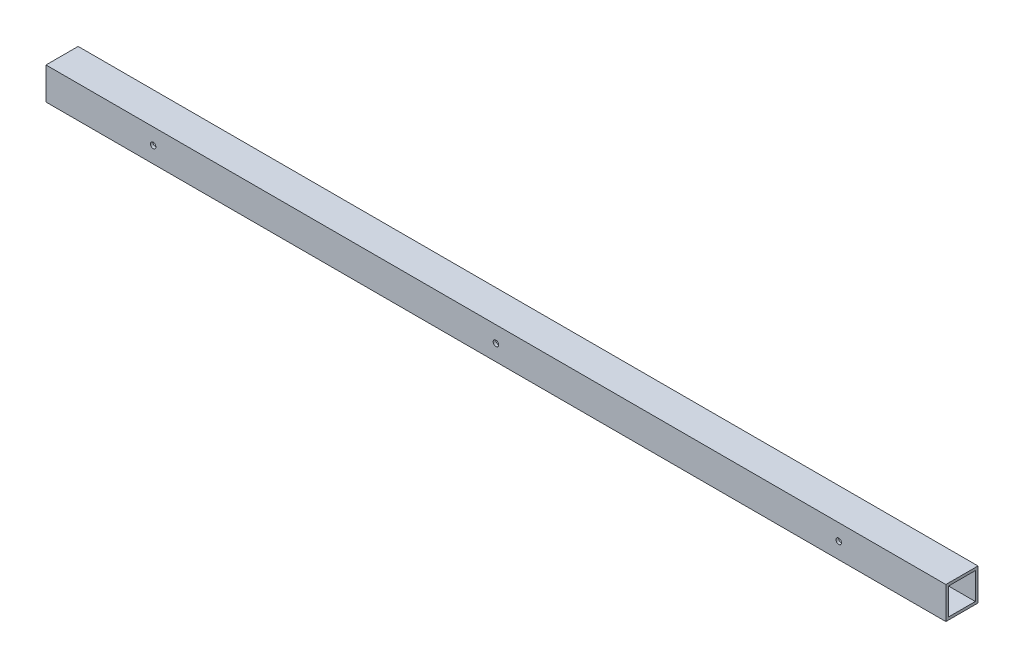
ISO-10303-21;
HEADER;
FILE_DESCRIPTION(('STEP AP214'),'2;1');
FILE_NAME('part.step','',(''),(''),'','','');
FILE_SCHEMA(('AUTOMOTIVE_DESIGN { 1 0 10303 214 1 1 1 1 }'));
ENDSEC;
DATA;
#1=APPLICATION_CONTEXT('core data for automotive mechanical design processes');
#2=APPLICATION_PROTOCOL_DEFINITION('international standard','automotive_design',2000,#1);
#3=PRODUCT_CONTEXT('',#1,'mechanical');
#4=PRODUCT('Part','Part','',(#3));
#5=PRODUCT_RELATED_PRODUCT_CATEGORY('part','',(#4));
#6=PRODUCT_DEFINITION_FORMATION('','',#4);
#7=PRODUCT_DEFINITION_CONTEXT('part definition',#1,'design');
#8=PRODUCT_DEFINITION('design','',#6,#7);
#9=PRODUCT_DEFINITION_SHAPE('','',#8);
#10=(LENGTH_UNIT() NAMED_UNIT(*) SI_UNIT(.MILLI.,.METRE.));
#11=(NAMED_UNIT(*) PLANE_ANGLE_UNIT() SI_UNIT($,.RADIAN.));
#12=(NAMED_UNIT(*) SI_UNIT($,.STERADIAN.) SOLID_ANGLE_UNIT());
#13=UNCERTAINTY_MEASURE_WITH_UNIT(LENGTH_MEASURE(1.E-05),#10,'distance_accuracy_value','');
#14=(GEOMETRIC_REPRESENTATION_CONTEXT(3) GLOBAL_UNCERTAINTY_ASSIGNED_CONTEXT((#13)) GLOBAL_UNIT_ASSIGNED_CONTEXT((#10,
#11,#12)) REPRESENTATION_CONTEXT('',''));
#15=CARTESIAN_POINT('',(0.,0.,0.));
#16=DIRECTION('',(0.,0.,1.));
#17=DIRECTION('',(1.,0.,0.));
#18=AXIS2_PLACEMENT_3D('',#15,#16,#17);
#19=CARTESIAN_POINT('',(0.,0.,22.86));
#20=DIRECTION('',(0.,0.,-1.));
#21=DIRECTION('',(-1.,0.,0.));
#22=AXIS2_PLACEMENT_3D('',#19,#20,#21);
#23=CYLINDRICAL_SURFACE('',#22,3.302);
#24=CARTESIAN_POINT('',(0.,0.,19.05));
#25=DIRECTION('',(0.,0.,-1.));
#26=DIRECTION('',(-1.,0.,0.));
#27=AXIS2_PLACEMENT_3D('',#24,#25,#26);
#28=CIRCLE('',#27,3.302);
#29=CARTESIAN_POINT('',(-3.302,0.,19.05));
#30=VERTEX_POINT('',#29);
#31=EDGE_CURVE('E120',#30,#30,#28,.T.);
#32=ORIENTED_EDGE('',*,*,#31,.F.);
#33=EDGE_LOOP('',(#32));
#34=FACE_BOUND('',#33,.T.);
#35=CARTESIAN_POINT('',(0.,0.,15.875));
#36=DIRECTION('',(0.,0.,-1.));
#37=DIRECTION('',(-1.,0.,0.));
#38=AXIS2_PLACEMENT_3D('',#35,#36,#37);
#39=CIRCLE('',#38,3.302);
#40=CARTESIAN_POINT('',(-3.302,0.,15.875));
#41=VERTEX_POINT('',#40);
#42=EDGE_CURVE('E91',#41,#41,#39,.F.);
#43=ORIENTED_EDGE('',*,*,#42,.F.);
#44=EDGE_LOOP('',(#43));
#45=FACE_BOUND('',#44,.T.);
#46=ADVANCED_FACE('F17',(#34,#45),#23,.F.);
#47=CARTESIAN_POINT('',(406.4,0.,22.86));
#48=DIRECTION('',(0.,0.,-1.));
#49=DIRECTION('',(-1.,0.,0.));
#50=AXIS2_PLACEMENT_3D('',#47,#48,#49);
#51=CYLINDRICAL_SURFACE('',#50,3.302);
#52=CARTESIAN_POINT('',(406.4,0.,15.875));
#53=DIRECTION('',(0.,0.,-1.));
#54=DIRECTION('',(-1.,0.,0.));
#55=AXIS2_PLACEMENT_3D('',#52,#53,#54);
#56=CIRCLE('',#55,3.302);
#57=CARTESIAN_POINT('',(403.098,0.,15.875));
#58=VERTEX_POINT('',#57);
#59=EDGE_CURVE('E147',#58,#58,#56,.F.);
#60=ORIENTED_EDGE('',*,*,#59,.F.);
#61=EDGE_LOOP('',(#60));
#62=FACE_BOUND('',#61,.T.);
#63=CARTESIAN_POINT('',(406.4,0.,19.05));
#64=DIRECTION('',(0.,0.,-1.));
#65=DIRECTION('',(-1.,0.,0.));
#66=AXIS2_PLACEMENT_3D('',#63,#64,#65);
#67=CIRCLE('',#66,3.302);
#68=CARTESIAN_POINT('',(403.098,0.,19.05));
#69=VERTEX_POINT('',#68);
#70=EDGE_CURVE('E140',#69,#69,#67,.T.);
#71=ORIENTED_EDGE('',*,*,#70,.F.);
#72=EDGE_LOOP('',(#71));
#73=FACE_BOUND('',#72,.T.);
#74=ADVANCED_FACE('F329',(#62,#73),#51,.F.);
#75=CARTESIAN_POINT('',(-406.4,0.,22.86));
#76=DIRECTION('',(0.,0.,-1.));
#77=DIRECTION('',(-1.,0.,0.));
#78=AXIS2_PLACEMENT_3D('',#75,#76,#77);
#79=CYLINDRICAL_SURFACE('',#78,3.302);
#80=CARTESIAN_POINT('',(-406.4,0.,15.875));
#81=DIRECTION('',(0.,0.,-1.));
#82=DIRECTION('',(-1.,0.,0.));
#83=AXIS2_PLACEMENT_3D('',#80,#81,#82);
#84=CIRCLE('',#83,3.302);
#85=CARTESIAN_POINT('',(-409.702,0.,15.875));
#86=VERTEX_POINT('',#85);
#87=EDGE_CURVE('E123',#86,#86,#84,.F.);
#88=ORIENTED_EDGE('',*,*,#87,.F.);
#89=EDGE_LOOP('',(#88));
#90=FACE_BOUND('',#89,.T.);
#91=CARTESIAN_POINT('',(-406.4,0.,19.05));
#92=DIRECTION('',(0.,0.,-1.));
#93=DIRECTION('',(-1.,0.,0.));
#94=AXIS2_PLACEMENT_3D('',#91,#92,#93);
#95=CIRCLE('',#94,3.302);
#96=CARTESIAN_POINT('',(-409.702,0.,19.05));
#97=VERTEX_POINT('',#96);
#98=EDGE_CURVE('E116',#97,#97,#95,.T.);
#99=ORIENTED_EDGE('',*,*,#98,.F.);
#100=EDGE_LOOP('',(#99));
#101=FACE_BOUND('',#100,.T.);
#102=ADVANCED_FACE('F167',(#90,#101),#79,.F.);
#103=CARTESIAN_POINT('',(0.,0.,22.86));
#104=DIRECTION('',(0.,0.,-1.));
#105=DIRECTION('',(-1.,0.,0.));
#106=AXIS2_PLACEMENT_3D('',#103,#104,#105);
#107=CYLINDRICAL_SURFACE('',#106,3.302);
#108=CARTESIAN_POINT('',(0.,0.,-15.875));
#109=DIRECTION('',(0.,0.,-1.));
#110=DIRECTION('',(-1.,0.,0.));
#111=AXIS2_PLACEMENT_3D('',#108,#109,#110);
#112=CIRCLE('',#111,3.302);
#113=CARTESIAN_POINT('',(-3.302,0.,-15.875));
#114=VERTEX_POINT('',#113);
#115=EDGE_CURVE('E20',#114,#114,#112,.T.);
#116=ORIENTED_EDGE('',*,*,#115,.F.);
#117=EDGE_LOOP('',(#116));
#118=FACE_BOUND('',#117,.T.);
#119=CARTESIAN_POINT('',(0.,0.,-19.05));
#120=DIRECTION('',(0.,0.,-1.));
#121=DIRECTION('',(-1.,0.,0.));
#122=AXIS2_PLACEMENT_3D('',#119,#120,#121);
#123=CIRCLE('',#122,3.302);
#124=CARTESIAN_POINT('',(-3.302,0.,-19.05));
#125=VERTEX_POINT('',#124);
#126=EDGE_CURVE('E134',#125,#125,#123,.F.);
#127=ORIENTED_EDGE('',*,*,#126,.F.);
#128=EDGE_LOOP('',(#127));
#129=FACE_BOUND('',#128,.T.);
#130=ADVANCED_FACE('F163',(#118,#129),#107,.F.);
#131=CARTESIAN_POINT('',(406.4,0.,22.86));
#132=DIRECTION('',(0.,0.,-1.));
#133=DIRECTION('',(-1.,0.,0.));
#134=AXIS2_PLACEMENT_3D('',#131,#132,#133);
#135=CYLINDRICAL_SURFACE('',#134,3.302);
#136=CARTESIAN_POINT('',(406.4,0.,-15.875));
#137=DIRECTION('',(0.,0.,-1.));
#138=DIRECTION('',(-1.,0.,0.));
#139=AXIS2_PLACEMENT_3D('',#136,#137,#138);
#140=CIRCLE('',#139,3.302);
#141=CARTESIAN_POINT('',(403.098,0.,-15.875));
#142=VERTEX_POINT('',#141);
#143=EDGE_CURVE('E153',#142,#142,#140,.T.);
#144=ORIENTED_EDGE('',*,*,#143,.F.);
#145=EDGE_LOOP('',(#144));
#146=FACE_BOUND('',#145,.T.);
#147=CARTESIAN_POINT('',(406.4,0.,-19.05));
#148=DIRECTION('',(0.,0.,-1.));
#149=DIRECTION('',(-1.,0.,0.));
#150=AXIS2_PLACEMENT_3D('',#147,#148,#149);
#151=CIRCLE('',#150,3.302);
#152=CARTESIAN_POINT('',(403.098,0.,-19.05));
#153=VERTEX_POINT('',#152);
#154=EDGE_CURVE('E131',#153,#153,#151,.F.);
#155=ORIENTED_EDGE('',*,*,#154,.F.);
#156=EDGE_LOOP('',(#155));
#157=FACE_BOUND('',#156,.T.);
#158=ADVANCED_FACE('F166',(#146,#157),#135,.F.);
#159=CARTESIAN_POINT('',(-406.4,0.,22.86));
#160=DIRECTION('',(0.,0.,-1.));
#161=DIRECTION('',(-1.,0.,0.));
#162=AXIS2_PLACEMENT_3D('',#159,#160,#161);
#163=CYLINDRICAL_SURFACE('',#162,3.302);
#164=CARTESIAN_POINT('',(-406.4,0.,-15.875));
#165=DIRECTION('',(0.,0.,-1.));
#166=DIRECTION('',(-1.,0.,0.));
#167=AXIS2_PLACEMENT_3D('',#164,#165,#166);
#168=CIRCLE('',#167,3.302);
#169=CARTESIAN_POINT('',(-409.702,0.,-15.875));
#170=VERTEX_POINT('',#169);
#171=EDGE_CURVE('E126',#170,#170,#168,.T.);
#172=ORIENTED_EDGE('',*,*,#171,.F.);
#173=EDGE_LOOP('',(#172));
#174=FACE_BOUND('',#173,.T.);
#175=CARTESIAN_POINT('',(-406.4,0.,-19.05));
#176=DIRECTION('',(0.,0.,-1.));
#177=DIRECTION('',(-1.,0.,0.));
#178=AXIS2_PLACEMENT_3D('',#175,#176,#177);
#179=CIRCLE('',#178,3.302);
#180=CARTESIAN_POINT('',(-409.702,0.,-19.05));
#181=VERTEX_POINT('',#180);
#182=EDGE_CURVE('E127',#181,#181,#179,.F.);
#183=ORIENTED_EDGE('',*,*,#182,.F.);
#184=EDGE_LOOP('',(#183));
#185=FACE_BOUND('',#184,.T.);
#186=ADVANCED_FACE('F296',(#174,#185),#163,.F.);
#187=CARTESIAN_POINT('',(-533.4,-19.05,19.05));
#188=DIRECTION('',(0.,-1.,0.));
#189=DIRECTION('',(0.,0.,-1.));
#190=AXIS2_PLACEMENT_3D('',#187,#188,#189);
#191=PLANE('',#190);
#192=DIRECTION('',(1.,0.,0.));
#193=VECTOR('',#192,1.);
#194=CARTESIAN_POINT('',(-533.4,-19.05,19.05));
#195=LINE('',#194,#193);
#196=CARTESIAN_POINT('',(-533.4,-19.05,19.05));
#197=VERTEX_POINT('',#196);
#198=CARTESIAN_POINT('',(533.4,-19.05,19.05));
#199=VERTEX_POINT('',#198);
#200=EDGE_CURVE('E117',#197,#199,#195,.T.);
#201=ORIENTED_EDGE('',*,*,#200,.F.);
#202=DIRECTION('',(0.,0.,-1.));
#203=VECTOR('',#202,1.);
#204=CARTESIAN_POINT('',(-533.4,-19.05,0.));
#205=LINE('',#204,#203);
#206=CARTESIAN_POINT('',(-533.4,-19.05,-19.05));
#207=VERTEX_POINT('',#206);
#208=EDGE_CURVE('E185',#197,#207,#205,.T.);
#209=ORIENTED_EDGE('',*,*,#208,.T.);
#210=DIRECTION('',(-1.,0.,0.));
#211=VECTOR('',#210,1.);
#212=CARTESIAN_POINT('',(-533.4,-19.05,-19.05));
#213=LINE('',#212,#211);
#214=CARTESIAN_POINT('',(533.4,-19.05,-19.05));
#215=VERTEX_POINT('',#214);
#216=EDGE_CURVE('E137',#215,#207,#213,.T.);
#217=ORIENTED_EDGE('',*,*,#216,.F.);
#218=DIRECTION('',(0.,0.,-1.));
#219=VECTOR('',#218,1.);
#220=CARTESIAN_POINT('',(533.4,-19.05,0.));
#221=LINE('',#220,#219);
#222=EDGE_CURVE('E108',#199,#215,#221,.T.);
#223=ORIENTED_EDGE('',*,*,#222,.F.);
#224=EDGE_LOOP('',(#201,#209,#217,#223));
#225=FACE_BOUND('',#224,.T.);
#226=ADVANCED_FACE('F216',(#225),#191,.T.);
#227=CARTESIAN_POINT('',(-533.4,15.875,-15.875));
#228=DIRECTION('',(0.,0.,1.));
#229=DIRECTION('',(1.,0.,0.));
#230=AXIS2_PLACEMENT_3D('',#227,#228,#229);
#231=PLANE('',#230);
#232=ORIENTED_EDGE('',*,*,#171,.T.);
#233=EDGE_LOOP('',(#232));
#234=FACE_BOUND('',#233,.T.);
#235=ORIENTED_EDGE('',*,*,#143,.T.);
#236=EDGE_LOOP('',(#235));
#237=FACE_BOUND('',#236,.T.);
#238=ORIENTED_EDGE('',*,*,#115,.T.);
#239=EDGE_LOOP('',(#238));
#240=FACE_BOUND('',#239,.T.);
#241=DIRECTION('',(1.,0.,0.));
#242=VECTOR('',#241,1.);
#243=CARTESIAN_POINT('',(-533.4,15.875,-15.875));
#244=LINE('',#243,#242);
#245=CARTESIAN_POINT('',(-533.4,15.875,-15.875));
#246=VERTEX_POINT('',#245);
#247=CARTESIAN_POINT('',(533.4,15.875,-15.875));
#248=VERTEX_POINT('',#247);
#249=EDGE_CURVE('E122',#246,#248,#244,.T.);
#250=ORIENTED_EDGE('',*,*,#249,.F.);
#251=DIRECTION('',(0.,1.,0.));
#252=VECTOR('',#251,1.);
#253=CARTESIAN_POINT('',(-533.4,0.,-15.875));
#254=LINE('',#253,#252);
#255=CARTESIAN_POINT('',(-533.4,-15.875,-15.875));
#256=VERTEX_POINT('',#255);
#257=EDGE_CURVE('E187',#246,#256,#254,.F.);
#258=ORIENTED_EDGE('',*,*,#257,.T.);
#259=DIRECTION('',(1.,0.,0.));
#260=VECTOR('',#259,1.);
#261=CARTESIAN_POINT('',(-533.4,-15.875,-15.875));
#262=LINE('',#261,#260);
#263=CARTESIAN_POINT('',(533.4,-15.875,-15.875));
#264=VERTEX_POINT('',#263);
#265=EDGE_CURVE('E92',#264,#256,#262,.F.);
#266=ORIENTED_EDGE('',*,*,#265,.F.);
#267=DIRECTION('',(0.,1.,0.));
#268=VECTOR('',#267,1.);
#269=CARTESIAN_POINT('',(533.4,0.,-15.875));
#270=LINE('',#269,#268);
#271=EDGE_CURVE('E107',#248,#264,#270,.F.);
#272=ORIENTED_EDGE('',*,*,#271,.F.);
#273=EDGE_LOOP('',(#250,#258,#266,#272));
#274=FACE_BOUND('',#273,.T.);
#275=ADVANCED_FACE('F160',(#234,#237,#240,#274),#231,.T.);
#276=CARTESIAN_POINT('',(-533.4,-15.875,-15.875));
#277=DIRECTION('',(0.,1.,0.));
#278=DIRECTION('',(0.,0.,1.));
#279=AXIS2_PLACEMENT_3D('',#276,#277,#278);
#280=PLANE('',#279);
#281=ORIENTED_EDGE('',*,*,#265,.T.);
#282=DIRECTION('',(0.,0.,-1.));
#283=VECTOR('',#282,1.);
#284=CARTESIAN_POINT('',(-533.4,-15.875,0.));
#285=LINE('',#284,#283);
#286=CARTESIAN_POINT('',(-533.4,-15.875,15.875));
#287=VERTEX_POINT('',#286);
#288=EDGE_CURVE('E88',#256,#287,#285,.F.);
#289=ORIENTED_EDGE('',*,*,#288,.T.);
#290=DIRECTION('',(-1.,0.,0.));
#291=VECTOR('',#290,1.);
#292=CARTESIAN_POINT('',(-533.4,-15.875,15.875));
#293=LINE('',#292,#291);
#294=CARTESIAN_POINT('',(533.4,-15.875,15.875));
#295=VERTEX_POINT('',#294);
#296=EDGE_CURVE('E80',#295,#287,#293,.T.);
#297=ORIENTED_EDGE('',*,*,#296,.F.);
#298=DIRECTION('',(0.,0.,-1.));
#299=VECTOR('',#298,1.);
#300=CARTESIAN_POINT('',(533.4,-15.875,0.));
#301=LINE('',#300,#299);
#302=EDGE_CURVE('E85',#264,#295,#301,.F.);
#303=ORIENTED_EDGE('',*,*,#302,.F.);
#304=EDGE_LOOP('',(#281,#289,#297,#303));
#305=FACE_BOUND('',#304,.T.);
#306=ADVANCED_FACE('F83',(#305),#280,.T.);
#307=CARTESIAN_POINT('',(-533.4,-15.875,15.875));
#308=DIRECTION('',(0.,0.,-1.));
#309=DIRECTION('',(-1.,0.,0.));
#310=AXIS2_PLACEMENT_3D('',#307,#308,#309);
#311=PLANE('',#310);
#312=ORIENTED_EDGE('',*,*,#87,.T.);
#313=EDGE_LOOP('',(#312));
#314=FACE_BOUND('',#313,.T.);
#315=ORIENTED_EDGE('',*,*,#59,.T.);
#316=EDGE_LOOP('',(#315));
#317=FACE_BOUND('',#316,.T.);
#318=ORIENTED_EDGE('',*,*,#42,.T.);
#319=EDGE_LOOP('',(#318));
#320=FACE_BOUND('',#319,.T.);
#321=ORIENTED_EDGE('',*,*,#296,.T.);
#322=DIRECTION('',(0.,1.,0.));
#323=VECTOR('',#322,1.);
#324=CARTESIAN_POINT('',(-533.4,0.,15.875));
#325=LINE('',#324,#323);
#326=CARTESIAN_POINT('',(-533.4,15.875,15.875));
#327=VERTEX_POINT('',#326);
#328=EDGE_CURVE('E203',#287,#327,#325,.T.);
#329=ORIENTED_EDGE('',*,*,#328,.T.);
#330=DIRECTION('',(1.,0.,0.));
#331=VECTOR('',#330,1.);
#332=CARTESIAN_POINT('',(-533.4,15.875,15.875));
#333=LINE('',#332,#331);
#334=CARTESIAN_POINT('',(533.4,15.875,15.875));
#335=VERTEX_POINT('',#334);
#336=EDGE_CURVE('E98',#335,#327,#333,.F.);
#337=ORIENTED_EDGE('',*,*,#336,.F.);
#338=DIRECTION('',(0.,1.,0.));
#339=VECTOR('',#338,1.);
#340=CARTESIAN_POINT('',(533.4,0.,15.875));
#341=LINE('',#340,#339);
#342=EDGE_CURVE('E95',#295,#335,#341,.T.);
#343=ORIENTED_EDGE('',*,*,#342,.F.);
#344=EDGE_LOOP('',(#321,#329,#337,#343));
#345=FACE_BOUND('',#344,.T.);
#346=ADVANCED_FACE('F96',(#314,#317,#320,#345),#311,.T.);
#347=CARTESIAN_POINT('',(-533.4,15.875,15.875));
#348=DIRECTION('',(0.,-1.,0.));
#349=DIRECTION('',(0.,0.,-1.));
#350=AXIS2_PLACEMENT_3D('',#347,#348,#349);
#351=PLANE('',#350);
#352=ORIENTED_EDGE('',*,*,#336,.T.);
#353=DIRECTION('',(0.,0.,-1.));
#354=VECTOR('',#353,1.);
#355=CARTESIAN_POINT('',(-533.4,15.875,0.));
#356=LINE('',#355,#354);
#357=EDGE_CURVE('E200',#327,#246,#356,.T.);
#358=ORIENTED_EDGE('',*,*,#357,.T.);
#359=ORIENTED_EDGE('',*,*,#249,.T.);
#360=DIRECTION('',(0.,0.,-1.));
#361=VECTOR('',#360,1.);
#362=CARTESIAN_POINT('',(533.4,15.875,0.));
#363=LINE('',#362,#361);
#364=EDGE_CURVE('E102',#335,#248,#363,.T.);
#365=ORIENTED_EDGE('',*,*,#364,.F.);
#366=EDGE_LOOP('',(#352,#358,#359,#365));
#367=FACE_BOUND('',#366,.T.);
#368=ADVANCED_FACE('F197',(#367),#351,.T.);
#369=CARTESIAN_POINT('',(-533.4,19.05,19.05));
#370=DIRECTION('',(0.,0.,1.));
#371=DIRECTION('',(1.,0.,0.));
#372=AXIS2_PLACEMENT_3D('',#369,#370,#371);
#373=PLANE('',#372);
#374=ORIENTED_EDGE('',*,*,#98,.T.);
#375=EDGE_LOOP('',(#374));
#376=FACE_BOUND('',#375,.T.);
#377=ORIENTED_EDGE('',*,*,#70,.T.);
#378=EDGE_LOOP('',(#377));
#379=FACE_BOUND('',#378,.T.);
#380=ORIENTED_EDGE('',*,*,#31,.T.);
#381=EDGE_LOOP('',(#380));
#382=FACE_BOUND('',#381,.T.);
#383=DIRECTION('',(1.,0.,0.));
#384=VECTOR('',#383,1.);
#385=CARTESIAN_POINT('',(-533.4,19.05,19.05));
#386=LINE('',#385,#384);
#387=CARTESIAN_POINT('',(-533.4,19.05,19.05));
#388=VERTEX_POINT('',#387);
#389=CARTESIAN_POINT('',(533.4,19.05,19.05));
#390=VERTEX_POINT('',#389);
#391=EDGE_CURVE('E207',#388,#390,#386,.T.);
#392=ORIENTED_EDGE('',*,*,#391,.F.);
#393=DIRECTION('',(0.,1.,0.));
#394=VECTOR('',#393,1.);
#395=CARTESIAN_POINT('',(-533.4,0.,19.05));
#396=LINE('',#395,#394);
#397=EDGE_CURVE('E130',#388,#197,#396,.F.);
#398=ORIENTED_EDGE('',*,*,#397,.T.);
#399=ORIENTED_EDGE('',*,*,#200,.T.);
#400=DIRECTION('',(0.,1.,0.));
#401=VECTOR('',#400,1.);
#402=CARTESIAN_POINT('',(533.4,0.,19.05));
#403=LINE('',#402,#401);
#404=EDGE_CURVE('E110',#390,#199,#403,.F.);
#405=ORIENTED_EDGE('',*,*,#404,.F.);
#406=EDGE_LOOP('',(#392,#398,#399,#405));
#407=FACE_BOUND('',#406,.T.);
#408=ADVANCED_FACE('F218',(#376,#379,#382,#407),#373,.T.);
#409=CARTESIAN_POINT('',(533.4,0.,0.));
#410=DIRECTION('',(1.,0.,0.));
#411=DIRECTION('',(0.,0.,-1.));
#412=AXIS2_PLACEMENT_3D('',#409,#410,#411);
#413=PLANE('',#412);
#414=ORIENTED_EDGE('',*,*,#364,.T.);
#415=ORIENTED_EDGE('',*,*,#271,.T.);
#416=ORIENTED_EDGE('',*,*,#302,.T.);
#417=ORIENTED_EDGE('',*,*,#342,.T.);
#418=EDGE_LOOP('',(#414,#415,#416,#417));
#419=FACE_BOUND('',#418,.T.);
#420=DIRECTION('',(0.,1.,0.));
#421=VECTOR('',#420,1.);
#422=CARTESIAN_POINT('',(533.4,-19.05,-19.05));
#423=LINE('',#422,#421);
#424=CARTESIAN_POINT('',(533.4,19.05,-19.05));
#425=VERTEX_POINT('',#424);
#426=EDGE_CURVE('E178',#425,#215,#423,.F.);
#427=ORIENTED_EDGE('',*,*,#426,.F.);
#428=DIRECTION('',(0.,0.,1.));
#429=VECTOR('',#428,1.);
#430=CARTESIAN_POINT('',(533.4,19.05,-19.05));
#431=LINE('',#430,#429);
#432=EDGE_CURVE('E210',#390,#425,#431,.F.);
#433=ORIENTED_EDGE('',*,*,#432,.F.);
#434=ORIENTED_EDGE('',*,*,#404,.T.);
#435=ORIENTED_EDGE('',*,*,#222,.T.);
#436=EDGE_LOOP('',(#427,#433,#434,#435));
#437=FACE_BOUND('',#436,.T.);
#438=ADVANCED_FACE('F104',(#419,#437),#413,.T.);
#439=CARTESIAN_POINT('',(-533.4,-19.05,-19.05));
#440=DIRECTION('',(0.,0.,-1.));
#441=DIRECTION('',(-1.,0.,0.));
#442=AXIS2_PLACEMENT_3D('',#439,#440,#441);
#443=PLANE('',#442);
#444=ORIENTED_EDGE('',*,*,#182,.T.);
#445=EDGE_LOOP('',(#444));
#446=FACE_BOUND('',#445,.T.);
#447=ORIENTED_EDGE('',*,*,#154,.T.);
#448=EDGE_LOOP('',(#447));
#449=FACE_BOUND('',#448,.T.);
#450=ORIENTED_EDGE('',*,*,#126,.T.);
#451=EDGE_LOOP('',(#450));
#452=FACE_BOUND('',#451,.T.);
#453=ORIENTED_EDGE('',*,*,#216,.T.);
#454=DIRECTION('',(0.,1.,0.));
#455=VECTOR('',#454,1.);
#456=CARTESIAN_POINT('',(-533.4,0.,-19.05));
#457=LINE('',#456,#455);
#458=CARTESIAN_POINT('',(-533.4,19.05,-19.05));
#459=VERTEX_POINT('',#458);
#460=EDGE_CURVE('E35',#207,#459,#457,.T.);
#461=ORIENTED_EDGE('',*,*,#460,.T.);
#462=DIRECTION('',(1.,0.,0.));
#463=VECTOR('',#462,1.);
#464=CARTESIAN_POINT('',(-533.4,19.05,-19.05));
#465=LINE('',#464,#463);
#466=EDGE_CURVE('E26',#425,#459,#465,.F.);
#467=ORIENTED_EDGE('',*,*,#466,.F.);
#468=ORIENTED_EDGE('',*,*,#426,.T.);
#469=EDGE_LOOP('',(#453,#461,#467,#468));
#470=FACE_BOUND('',#469,.T.);
#471=ADVANCED_FACE('F171',(#446,#449,#452,#470),#443,.T.);
#472=CARTESIAN_POINT('',(-533.4,0.,0.));
#473=DIRECTION('',(1.,0.,0.));
#474=DIRECTION('',(0.,0.,-1.));
#475=AXIS2_PLACEMENT_3D('',#472,#473,#474);
#476=PLANE('',#475);
#477=ORIENTED_EDGE('',*,*,#328,.F.);
#478=ORIENTED_EDGE('',*,*,#288,.F.);
#479=ORIENTED_EDGE('',*,*,#257,.F.);
#480=ORIENTED_EDGE('',*,*,#357,.F.);
#481=EDGE_LOOP('',(#477,#478,#479,#480));
#482=FACE_BOUND('',#481,.T.);
#483=ORIENTED_EDGE('',*,*,#208,.F.);
#484=ORIENTED_EDGE('',*,*,#397,.F.);
#485=DIRECTION('',(0.,0.,1.));
#486=VECTOR('',#485,1.);
#487=CARTESIAN_POINT('',(-533.4,19.05,-19.05));
#488=LINE('',#487,#486);
#489=EDGE_CURVE('E11',#459,#388,#488,.T.);
#490=ORIENTED_EDGE('',*,*,#489,.F.);
#491=ORIENTED_EDGE('',*,*,#460,.F.);
#492=EDGE_LOOP('',(#483,#484,#490,#491));
#493=FACE_BOUND('',#492,.T.);
#494=ADVANCED_FACE('F173',(#482,#493),#476,.F.);
#495=CARTESIAN_POINT('',(-533.4,19.05,-19.05));
#496=DIRECTION('',(0.,1.,0.));
#497=DIRECTION('',(0.,0.,1.));
#498=AXIS2_PLACEMENT_3D('',#495,#496,#497);
#499=PLANE('',#498);
#500=ORIENTED_EDGE('',*,*,#466,.T.);
#501=ORIENTED_EDGE('',*,*,#489,.T.);
#502=ORIENTED_EDGE('',*,*,#391,.T.);
#503=ORIENTED_EDGE('',*,*,#432,.T.);
#504=EDGE_LOOP('',(#500,#501,#502,#503));
#505=FACE_BOUND('',#504,.T.);
#506=ADVANCED_FACE('F214',(#505),#499,.T.);
#507=CLOSED_SHELL('',(#46,#74,#102,#130,#158,#186,#226,#275,#306,#346,#368,#408,#438,#471,#494,#506));
#508=MANIFOLD_SOLID_BREP('B1',#507);
#509=ADVANCED_BREP_SHAPE_REPRESENTATION('',(#18,#508),#14);
#510=SHAPE_DEFINITION_REPRESENTATION(#9,#509);
ENDSEC;
END-ISO-10303-21;
